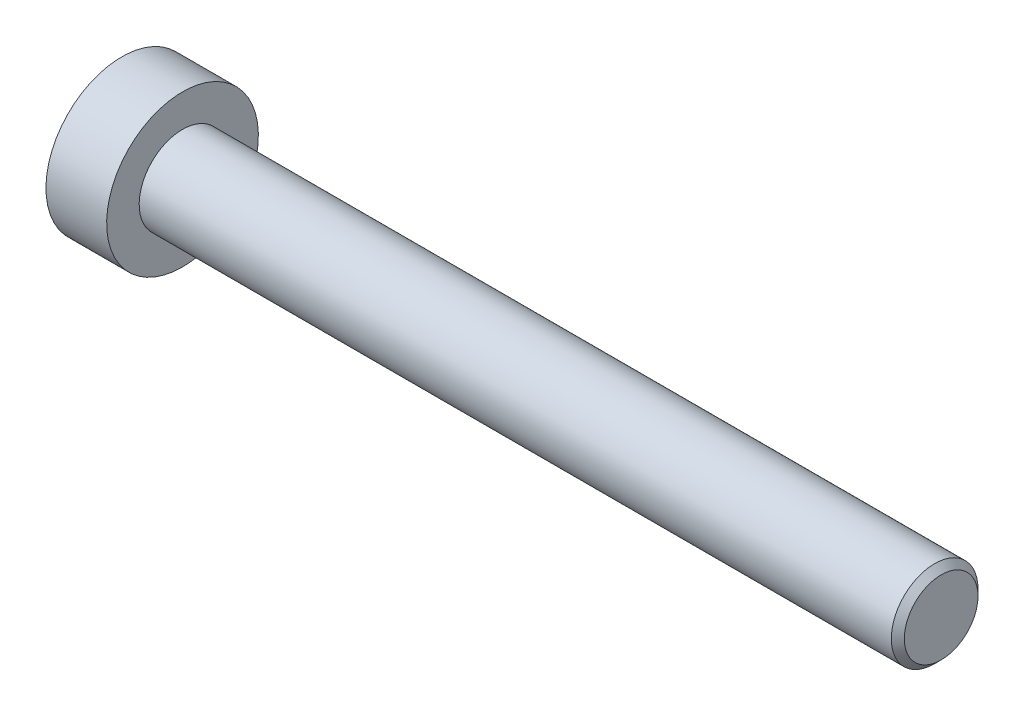
ISO-10303-21;
HEADER;
FILE_DESCRIPTION(('STEP AP214'),'2;1');
FILE_NAME('part.step','',(''),(''),'','','');
FILE_SCHEMA(('AUTOMOTIVE_DESIGN { 1 0 10303 214 1 1 1 1 }'));
ENDSEC;
DATA;
#1=APPLICATION_CONTEXT('core data for automotive mechanical design processes');
#2=APPLICATION_PROTOCOL_DEFINITION('international standard','automotive_design',2000,#1);
#3=PRODUCT_CONTEXT('',#1,'mechanical');
#4=PRODUCT('Part','Part','',(#3));
#5=PRODUCT_RELATED_PRODUCT_CATEGORY('part','',(#4));
#6=PRODUCT_DEFINITION_FORMATION('','',#4);
#7=PRODUCT_DEFINITION_CONTEXT('part definition',#1,'design');
#8=PRODUCT_DEFINITION('design','',#6,#7);
#9=PRODUCT_DEFINITION_SHAPE('','',#8);
#10=(LENGTH_UNIT() NAMED_UNIT(*) SI_UNIT(.MILLI.,.METRE.));
#11=(NAMED_UNIT(*) PLANE_ANGLE_UNIT() SI_UNIT($,.RADIAN.));
#12=(NAMED_UNIT(*) SI_UNIT($,.STERADIAN.) SOLID_ANGLE_UNIT());
#13=UNCERTAINTY_MEASURE_WITH_UNIT(LENGTH_MEASURE(1.E-05),#10,'distance_accuracy_value','');
#14=(GEOMETRIC_REPRESENTATION_CONTEXT(3) GLOBAL_UNCERTAINTY_ASSIGNED_CONTEXT((#13)) GLOBAL_UNIT_ASSIGNED_CONTEXT((#10,
#11,#12)) REPRESENTATION_CONTEXT('',''));
#15=CARTESIAN_POINT('',(0.,0.,0.));
#16=DIRECTION('',(0.,0.,1.));
#17=DIRECTION('',(1.,0.,0.));
#18=AXIS2_PLACEMENT_3D('',#15,#16,#17);
#19=CARTESIAN_POINT('',(-35.,0.,0.));
#20=DIRECTION('',(1.,0.,0.));
#21=DIRECTION('',(0.,0.,-1.));
#22=AXIS2_PLACEMENT_3D('',#19,#20,#21);
#23=CYLINDRICAL_SURFACE('',#22,2.);
#24=CARTESIAN_POINT('',(-0.299999999999995,0.,0.));
#25=DIRECTION('',(1.,0.,0.));
#26=DIRECTION('',(0.,0.,-1.));
#27=AXIS2_PLACEMENT_3D('',#24,#25,#26);
#28=CIRCLE('',#27,2.);
#29=CARTESIAN_POINT('',(-0.299999999999995,0.,-2.));
#30=VERTEX_POINT('',#29);
#31=EDGE_CURVE('E46',#30,#30,#28,.F.);
#32=ORIENTED_EDGE('',*,*,#31,.T.);
#33=EDGE_LOOP('',(#32));
#34=FACE_BOUND('',#33,.T.);
#35=CARTESIAN_POINT('',(-35.,0.,0.));
#36=DIRECTION('',(-1.,0.,0.));
#37=DIRECTION('',(0.,-1.,0.));
#38=AXIS2_PLACEMENT_3D('',#35,#36,#37);
#39=CIRCLE('',#38,2.);
#40=CARTESIAN_POINT('',(-35.,-2.00000000000001,0.));
#41=VERTEX_POINT('',#40);
#42=EDGE_CURVE('E122',#41,#41,#39,.F.);
#43=ORIENTED_EDGE('',*,*,#42,.T.);
#44=EDGE_LOOP('',(#43));
#45=FACE_BOUND('',#44,.T.);
#46=ADVANCED_FACE('F33',(#34,#45),#23,.T.);
#47=CARTESIAN_POINT('',(0.,0.,0.));
#48=DIRECTION('',(1.,0.,0.));
#49=DIRECTION('',(0.,0.,-1.));
#50=AXIS2_PLACEMENT_3D('',#47,#48,#49);
#51=PLANE('',#50);
#52=CARTESIAN_POINT('',(0.,0.,0.));
#53=DIRECTION('',(1.,0.,0.));
#54=DIRECTION('',(0.,0.,-1.));
#55=AXIS2_PLACEMENT_3D('',#52,#53,#54);
#56=CIRCLE('',#55,1.7);
#57=CARTESIAN_POINT('',(0.,0.,-1.7));
#58=VERTEX_POINT('',#57);
#59=EDGE_CURVE('E125',#58,#58,#56,.T.);
#60=ORIENTED_EDGE('',*,*,#59,.T.);
#61=EDGE_LOOP('',(#60));
#62=FACE_BOUND('',#61,.T.);
#63=ADVANCED_FACE('F135',(#62),#51,.T.);
#64=CARTESIAN_POINT('',(0.,0.,0.));
#65=DIRECTION('',(-1.,0.,0.));
#66=DIRECTION('',(0.,0.,1.));
#67=AXIS2_PLACEMENT_3D('',#64,#65,#66);
#68=CONICAL_SURFACE('',#67,1.7,0.785398163397451);
#69=ORIENTED_EDGE('',*,*,#31,.F.);
#70=EDGE_LOOP('',(#69));
#71=FACE_BOUND('',#70,.T.);
#72=ORIENTED_EDGE('',*,*,#59,.F.);
#73=EDGE_LOOP('',(#72));
#74=FACE_BOUND('',#73,.T.);
#75=ADVANCED_FACE('F35',(#71,#74),#68,.T.);
#76=CARTESIAN_POINT('',(-37.8,0.,0.));
#77=DIRECTION('',(1.,0.,0.));
#78=DIRECTION('',(0.,1.,0.));
#79=AXIS2_PLACEMENT_3D('',#76,#77,#78);
#80=PLANE('',#79);
#81=CARTESIAN_POINT('',(-37.8,1.44310190235113E-13,0.));
#82=DIRECTION('',(-1.,0.,0.));
#83=DIRECTION('',(0.,-1.,0.));
#84=AXIS2_PLACEMENT_3D('',#81,#82,#83);
#85=CIRCLE('',#84,1.49337567297405);
#86=CARTESIAN_POINT('',(-37.8,-1.49337567297391,0.));
#87=VERTEX_POINT('',#86);
#88=EDGE_CURVE('E235',#87,#87,#85,.T.);
#89=ORIENTED_EDGE('',*,*,#88,.F.);
#90=EDGE_LOOP('',(#89));
#91=FACE_BOUND('',#90,.T.);
#92=CARTESIAN_POINT('',(-37.8,0.,0.));
#93=DIRECTION('',(-1.,0.,0.));
#94=DIRECTION('',(0.,-1.,0.));
#95=AXIS2_PLACEMENT_3D('',#92,#93,#94);
#96=CIRCLE('',#95,3.5);
#97=CARTESIAN_POINT('',(-37.8,-3.50000000000001,0.));
#98=VERTEX_POINT('',#97);
#99=EDGE_CURVE('E119',#98,#98,#96,.T.);
#100=ORIENTED_EDGE('',*,*,#99,.T.);
#101=EDGE_LOOP('',(#100));
#102=FACE_BOUND('',#101,.T.);
#103=ADVANCED_FACE('F134',(#91,#102),#80,.F.);
#104=CARTESIAN_POINT('',(-35.,0.,0.));
#105=DIRECTION('',(-1.,0.,0.));
#106=DIRECTION('',(0.,-1.,0.));
#107=AXIS2_PLACEMENT_3D('',#104,#105,#106);
#108=CYLINDRICAL_SURFACE('',#107,3.5);
#109=ORIENTED_EDGE('',*,*,#99,.F.);
#110=EDGE_LOOP('',(#109));
#111=FACE_BOUND('',#110,.T.);
#112=CARTESIAN_POINT('',(-35.,0.,0.));
#113=DIRECTION('',(-1.,0.,0.));
#114=DIRECTION('',(0.,-1.,0.));
#115=AXIS2_PLACEMENT_3D('',#112,#113,#114);
#116=CIRCLE('',#115,3.5);
#117=CARTESIAN_POINT('',(-35.,-3.50000000000001,0.));
#118=VERTEX_POINT('',#117);
#119=EDGE_CURVE('E116',#118,#118,#116,.T.);
#120=ORIENTED_EDGE('',*,*,#119,.T.);
#121=EDGE_LOOP('',(#120));
#122=FACE_BOUND('',#121,.T.);
#123=ADVANCED_FACE('F146',(#111,#122),#108,.T.);
#124=CARTESIAN_POINT('',(-35.,3.5,0.));
#125=DIRECTION('',(-1.,0.,0.));
#126=DIRECTION('',(0.,-1.,0.));
#127=AXIS2_PLACEMENT_3D('',#124,#125,#126);
#128=PLANE('',#127);
#129=ORIENTED_EDGE('',*,*,#42,.F.);
#130=EDGE_LOOP('',(#129));
#131=FACE_BOUND('',#130,.T.);
#132=ORIENTED_EDGE('',*,*,#119,.F.);
#133=EDGE_LOOP('',(#132));
#134=FACE_BOUND('',#133,.T.);
#135=ADVANCED_FACE('F150',(#131,#134),#128,.F.);
#136=CARTESIAN_POINT('',(-37.8,1.44310190235113E-13,0.));
#137=DIRECTION('',(-1.,0.,0.));
#138=DIRECTION('',(0.,-1.,0.));
#139=AXIS2_PLACEMENT_3D('',#136,#137,#138);
#140=CONICAL_SURFACE('',#139,1.49337567297405,0.78539816339745);
#141=ORIENTED_EDGE('',*,*,#88,.T.);
#142=EDGE_LOOP('',(#141));
#143=FACE_BOUND('',#142,.T.);
#144=CARTESIAN_POINT('',(-38.2014021689884,-1.42396736984785,1.25));
#145=CARTESIAN_POINT('',(-38.1752961364481,-1.38922450814761,1.25));
#146=CARTESIAN_POINT('',(-38.1494506563431,-1.35428640192983,1.25));
#147=CARTESIAN_POINT('',(-38.0983879120234,-1.28394100441949,1.25));
#148=CARTESIAN_POINT('',(-38.0731708093588,-1.24853359598563,1.25));
#149=CARTESIAN_POINT('',(-37.9982633539511,-1.14097140016107,1.25));
#150=CARTESIAN_POINT('',(-37.9497190435972,-1.06800495826737,1.25));
#151=CARTESIAN_POINT('',(-37.8545600162985,-0.915095472420225,1.25));
#152=CARTESIAN_POINT('',(-37.8082030382604,-0.834990154954369,1.25));
#153=CARTESIAN_POINT('',(-37.7235039270025,-0.670798348959287,1.25));
#154=CARTESIAN_POINT('',(-37.6851347978723,-0.586726487937036,1.25));
#155=CARTESIAN_POINT('',(-37.6381985020476,-0.460385334768575,1.25));
#156=CARTESIAN_POINT('',(-37.6247021207698,-0.419954113336481,1.25));
#157=CARTESIAN_POINT('',(-37.6009573074475,-0.33812903129116,1.25));
#158=CARTESIAN_POINT('',(-37.5907091035293,-0.296735103284054,1.25));
#159=CARTESIAN_POINT('',(-37.5741594663553,-0.213916243687668,1.25));
#160=CARTESIAN_POINT('',(-37.5677913385525,-0.172504848949217,1.25));
#161=CARTESIAN_POINT('',(-37.5591237196609,-0.0892560954740761,1.25));
#162=CARTESIAN_POINT('',(-37.5568235599982,-0.0474188078701848,1.25));
#163=CARTESIAN_POINT('',(-37.5564564105194,0.0348235296906206,1.25));
#164=CARTESIAN_POINT('',(-37.5582455485416,0.0752279922917968,1.25));
#165=CARTESIAN_POINT('',(-37.5656448035135,0.155687005579725,1.25));
#166=CARTESIAN_POINT('',(-37.5712556629701,0.195741486738079,1.25));
#167=CARTESIAN_POINT('',(-37.5860898151071,0.275882483894785,1.25));
#168=CARTESIAN_POINT('',(-37.5953738895404,0.315957579678888,1.25));
#169=CARTESIAN_POINT('',(-37.6170656964992,0.395234027395396,1.25));
#170=CARTESIAN_POINT('',(-37.6294731489784,0.434435457319036,1.25));
#171=CARTESIAN_POINT('',(-37.6734108304631,0.558570325397234,1.25));
#172=CARTESIAN_POINT('',(-37.709974414329,0.641718054006054,1.25));
#173=CARTESIAN_POINT('',(-37.7912478873066,0.804100725662195,1.25));
#174=CARTESIAN_POINT('',(-37.8359871895298,0.883320183915984,1.25));
#175=CARTESIAN_POINT('',(-37.9282652286461,1.03470895505833,1.25));
#176=CARTESIAN_POINT('',(-37.9755534388818,1.10703287925049,1.25));
#177=CARTESIAN_POINT('',(-38.0486463209253,1.21358798649202,1.25));
#178=CARTESIAN_POINT('',(-38.0732664432996,1.24864609054893,1.25));
#179=CARTESIAN_POINT('',(-38.123155260131,1.3182838080566,1.25));
#180=CARTESIAN_POINT('',(-38.1484237758018,1.35286354944705,1.25));
#181=CARTESIAN_POINT('',(-38.1739610581169,1.38724419886399,1.25));
#182=B_SPLINE_CURVE_WITH_KNOTS('',3,(#144,#145,#146,#147,#148,#149,#150,#151,#152,#153,#154,
#155,#156,#157,#158,#159,#160,#161,#162,#163,#164,#165,#166,#167,#168,#169,#170,#171,#172,#173,
#174,#175,#176,#177,#178,#179,#180,#181),.UNSPECIFIED.,.F.,.F.,(4,2,2,2,2,2,2,2,2,2,2,2,2,2,2,2,
2,2,4),(0.,0.130370422461745,0.260774023229274,0.523571931962168,0.800995227642773,
1.0774651455394,1.20522972687281,1.33300327939669,1.45851355132213,1.58400319361987,
1.70514602294319,1.82631239533594,1.94957373840989,2.07282403363803,2.34451838945518,
2.61721016161581,2.87631588769058,3.00482945023597,3.13330794967358),.UNSPECIFIED.);
#183=CARTESIAN_POINT('',(-37.75,-0.721687836486888,1.25));
#184=VERTEX_POINT('',#183);
#185=CARTESIAN_POINT('',(-37.75,0.721687836487177,1.25));
#186=VERTEX_POINT('',#185);
#187=EDGE_CURVE('E100',#184,#186,#182,.T.);
#188=ORIENTED_EDGE('',*,*,#187,.F.);
#189=CARTESIAN_POINT('',(-37.7501154839092,-1.44349114302776,-0.000200000000001163));
#190=CARTESIAN_POINT('',(-37.7253216680551,-1.41867941875051,0.0427751670715872));
#191=CARTESIAN_POINT('',(-37.7019837344187,-1.39345276980729,0.0864690047459489));
#192=CARTESIAN_POINT('',(-37.6592520040846,-1.3420126355418,0.175565930841942));
#193=CARTESIAN_POINT('',(-37.6398819923604,-1.31579425481262,0.220977498357064));
#194=CARTESIAN_POINT('',(-37.6067004834135,-1.26292610442232,0.312547820935259));
#195=CARTESIAN_POINT('',(-37.5928055590527,-1.23628980770457,0.358683240175886));
#196=CARTESIAN_POINT('',(-37.5713972821607,-1.18243062538494,0.451970080407594));
#197=CARTESIAN_POINT('',(-37.5638679415668,-1.15520938653747,0.499118649136381));
#198=CARTESIAN_POINT('',(-37.5570744980507,-1.10829684367452,0.580373556887253));
#199=CARTESIAN_POINT('',(-37.5560685591044,-1.08866617256944,0.614374876627942));
#200=CARTESIAN_POINT('',(-37.5577614149113,-1.04943932800597,0.682317764432478));
#201=CARTESIAN_POINT('',(-37.5604610272156,-1.02984316311585,0.716259317655658));
#202=CARTESIAN_POINT('',(-37.5694089303164,-0.990839954603355,0.7838148564575));
#203=CARTESIAN_POINT('',(-37.5756605258997,-0.971433104248627,0.817428507286776));
#204=CARTESIAN_POINT('',(-37.5913756814139,-0.932943395609761,0.884094638217814));
#205=CARTESIAN_POINT('',(-37.6008406200875,-0.913860680098156,0.917146871030297));
#206=CARTESIAN_POINT('',(-37.6289313906876,-0.864986351354424,1.00179969160026));
#207=CARTESIAN_POINT('',(-37.6496701574522,-0.835502920148932,1.05286649242964));
#208=CARTESIAN_POINT('',(-37.6963871346715,-0.777690319475765,1.15300085411325));
#209=CARTESIAN_POINT('',(-37.7223482959468,-0.749357745598274,1.20207431157827));
#210=CARTESIAN_POINT('',(-37.7501154839091,-0.721572366433052,1.2502));
#211=B_SPLINE_CURVE_WITH_KNOTS('',3,(#189,#190,#191,#192,#193,#194,#195,#196,#197,#198,#199,
#200,#201,#202,#203,#204,#205,#206,#207,#208,#209,#210),.UNSPECIFIED.,.F.,.F.,(4,2,2,2,2,2,2,2,
2,2,4),(0.,0.166533409618306,0.334037607289763,0.498880396489701,0.663307919240277,
0.780963963458829,0.898645970148455,1.01643764860774,1.1342799317155,1.32148652032141,
1.50809158792573),.UNSPECIFIED.);
#212=CARTESIAN_POINT('',(-37.75,-1.44337567297392,0.));
#213=VERTEX_POINT('',#212);
#214=EDGE_CURVE('E192',#213,#184,#211,.T.);
#215=ORIENTED_EDGE('',*,*,#214,.F.);
#216=CARTESIAN_POINT('',(-37.7501154839091,-0.72157236643305,-1.2502));
#217=CARTESIAN_POINT('',(-37.7253216680551,-0.7463840907103,-1.20722483292841));
#218=CARTESIAN_POINT('',(-37.7019837344187,-0.77161073965352,-1.16353099525405));
#219=CARTESIAN_POINT('',(-37.6592520040845,-0.82305087391901,-1.07443406915806));
#220=CARTESIAN_POINT('',(-37.6398819923604,-0.849269254648188,-1.02902250164294));
#221=CARTESIAN_POINT('',(-37.6067004834135,-0.90213740503849,-0.937452179064742));
#222=CARTESIAN_POINT('',(-37.5928055590527,-0.928773701756242,-0.891316759824116));
#223=CARTESIAN_POINT('',(-37.5713972821607,-0.982632884075867,-0.79802991959241));
#224=CARTESIAN_POINT('',(-37.5638679415668,-1.00985412292334,-0.750881350863623));
#225=CARTESIAN_POINT('',(-37.5570744980507,-1.05676666578628,-0.669626443112752));
#226=CARTESIAN_POINT('',(-37.5560685591044,-1.07639733689137,-0.635625123372064));
#227=CARTESIAN_POINT('',(-37.5577614149113,-1.11562418145484,-0.567682235567528));
#228=CARTESIAN_POINT('',(-37.5604610272156,-1.13522034634496,-0.533740682344348));
#229=CARTESIAN_POINT('',(-37.5694089303164,-1.17422355485745,-0.466185143542506));
#230=CARTESIAN_POINT('',(-37.5756605258997,-1.19363040521218,-0.432571492713231));
#231=CARTESIAN_POINT('',(-37.5913756814139,-1.23212011385104,-0.365905361782193));
#232=CARTESIAN_POINT('',(-37.6008406200875,-1.25120282936265,-0.332853128969711));
#233=CARTESIAN_POINT('',(-37.6289313906876,-1.30007715810638,-0.248200308399741));
#234=CARTESIAN_POINT('',(-37.6496701574522,-1.32956058931187,-0.197133507570367));
#235=CARTESIAN_POINT('',(-37.6963871346715,-1.38737318998504,-0.096999145886748));
#236=CARTESIAN_POINT('',(-37.7223482959468,-1.41570576386254,-0.0479256884217322));
#237=CARTESIAN_POINT('',(-37.7501154839092,-1.44349114302776,0.000199999999998532));
#238=B_SPLINE_CURVE_WITH_KNOTS('',3,(#216,#217,#218,#219,#220,#221,#222,#223,#224,#225,#226,
#227,#228,#229,#230,#231,#232,#233,#234,#235,#236,#237),.UNSPECIFIED.,.F.,.F.,(4,2,2,2,2,2,2,2,
2,2,4),(0.,0.166533409618303,0.334037607289758,0.498880396489694,0.663307919240267,
0.780963963458819,0.898645970148445,1.01643764860772,1.13427993171549,1.3214865203214,
1.50809158792573),.UNSPECIFIED.);
#239=CARTESIAN_POINT('',(-37.75,-0.721687836486889,-1.25));
#240=VERTEX_POINT('',#239);
#241=EDGE_CURVE('E187',#240,#213,#238,.T.);
#242=ORIENTED_EDGE('',*,*,#241,.F.);
#243=CARTESIAN_POINT('',(-38.2014021689884,-1.42396736984784,-1.25));
#244=CARTESIAN_POINT('',(-38.1752961364481,-1.38922450814761,-1.25));
#245=CARTESIAN_POINT('',(-38.1494506563431,-1.35428640192982,-1.25));
#246=CARTESIAN_POINT('',(-38.0983879120234,-1.28394100441949,-1.25));
#247=CARTESIAN_POINT('',(-38.0731708093588,-1.24853359598563,-1.25));
#248=CARTESIAN_POINT('',(-37.9982633539511,-1.14097140016106,-1.25));
#249=CARTESIAN_POINT('',(-37.9497190435972,-1.06800495826737,-1.25));
#250=CARTESIAN_POINT('',(-37.8545600162985,-0.915095472420224,-1.25));
#251=CARTESIAN_POINT('',(-37.8082030382604,-0.834990154954368,-1.25));
#252=CARTESIAN_POINT('',(-37.7235039270025,-0.670798348959286,-1.25));
#253=CARTESIAN_POINT('',(-37.6851347978723,-0.586726487937035,-1.25));
#254=CARTESIAN_POINT('',(-37.6381985020476,-0.460385334768573,-1.25));
#255=CARTESIAN_POINT('',(-37.6247021207698,-0.419954113336479,-1.25));
#256=CARTESIAN_POINT('',(-37.6009573074475,-0.338129031291158,-1.25));
#257=CARTESIAN_POINT('',(-37.5907091035293,-0.296735103284052,-1.25));
#258=CARTESIAN_POINT('',(-37.5741594663553,-0.213916243687667,-1.25));
#259=CARTESIAN_POINT('',(-37.5677913385525,-0.172504848949215,-1.25));
#260=CARTESIAN_POINT('',(-37.5591237196609,-0.0892560954740745,-1.25));
#261=CARTESIAN_POINT('',(-37.5568235599982,-0.0474188078701832,-1.25));
#262=CARTESIAN_POINT('',(-37.5564564105194,0.0348235296906225,-1.25));
#263=CARTESIAN_POINT('',(-37.5582455485416,0.0752279922917989,-1.25));
#264=CARTESIAN_POINT('',(-37.5656448035135,0.155687005579727,-1.25));
#265=CARTESIAN_POINT('',(-37.5712556629701,0.195741486738081,-1.25));
#266=CARTESIAN_POINT('',(-37.5860898151071,0.275882483894789,-1.25));
#267=CARTESIAN_POINT('',(-37.5953738895404,0.315957579678893,-1.25));
#268=CARTESIAN_POINT('',(-37.6170656964992,0.3952340273954,-1.25));
#269=CARTESIAN_POINT('',(-37.6294731489784,0.434435457319039,-1.25));
#270=CARTESIAN_POINT('',(-37.6734108304631,0.558570325397238,-1.25));
#271=CARTESIAN_POINT('',(-37.709974414329,0.641718054006059,-1.25));
#272=CARTESIAN_POINT('',(-37.7912478873066,0.804100725662202,-1.25));
#273=CARTESIAN_POINT('',(-37.8359871895298,0.883320183915993,-1.25));
#274=CARTESIAN_POINT('',(-37.9282652286461,1.03470895505834,-1.25));
#275=CARTESIAN_POINT('',(-37.9755534388818,1.1070328792505,-1.25));
#276=CARTESIAN_POINT('',(-38.0486463209253,1.21358798649203,-1.25));
#277=CARTESIAN_POINT('',(-38.0732664432996,1.24864609054894,-1.25));
#278=CARTESIAN_POINT('',(-38.1231552601311,1.31828380805661,-1.25));
#279=CARTESIAN_POINT('',(-38.1484237758018,1.35286354944706,-1.25));
#280=CARTESIAN_POINT('',(-38.1739610581169,1.38724419886399,-1.25));
#281=B_SPLINE_CURVE_WITH_KNOTS('',3,(#243,#244,#245,#246,#247,#248,#249,#250,#251,#252,#253,
#254,#255,#256,#257,#258,#259,#260,#261,#262,#263,#264,#265,#266,#267,#268,#269,#270,#271,#272,
#273,#274,#275,#276,#277,#278,#279,#280),.UNSPECIFIED.,.F.,.F.,(4,2,2,2,2,2,2,2,2,2,2,2,2,2,2,2,
2,2,4),(0.,0.130370422461745,0.260774023229275,0.523571931962167,0.800995227642771,
1.0774651455394,1.20522972687281,1.33300327939669,1.45851355132213,1.58400319361987,
1.70514602294319,1.82631239533594,1.94957373840989,2.07282403363803,2.34451838945518,
2.61721016161582,2.87631588769059,3.00482945023599,3.13330794967359),.UNSPECIFIED.);
#282=CARTESIAN_POINT('',(-37.75,0.721687836487177,-1.25));
#283=VERTEX_POINT('',#282);
#284=EDGE_CURVE('E53',#283,#240,#281,.F.);
#285=ORIENTED_EDGE('',*,*,#284,.F.);
#286=CARTESIAN_POINT('',(-37.7501154839091,1.44349114302805,0.000199999999999847));
#287=CARTESIAN_POINT('',(-37.7253216680551,1.4186794187508,-0.0427751670715873));
#288=CARTESIAN_POINT('',(-37.7019837344187,1.39345276980758,-0.0864690047459491));
#289=CARTESIAN_POINT('',(-37.6592520040845,1.34201263554209,-0.175565930841943));
#290=CARTESIAN_POINT('',(-37.6398819923604,1.31579425481291,-0.220977498357064));
#291=CARTESIAN_POINT('',(-37.6067004834135,1.26292610442261,-0.312547820935259));
#292=CARTESIAN_POINT('',(-37.5928055590527,1.23628980770485,-0.358683240175885));
#293=CARTESIAN_POINT('',(-37.5713972821606,1.18243062538523,-0.451970080407591));
#294=CARTESIAN_POINT('',(-37.5638679415668,1.15520938653776,-0.499118649136378));
#295=CARTESIAN_POINT('',(-37.5570744980507,1.10829684367481,-0.580373556887251));
#296=CARTESIAN_POINT('',(-37.5560685591044,1.08866617256972,-0.61437487662794));
#297=CARTESIAN_POINT('',(-37.5577614149113,1.04943932800625,-0.682317764432476));
#298=CARTESIAN_POINT('',(-37.5604610272155,1.02984316311614,-0.716259317655656));
#299=CARTESIAN_POINT('',(-37.5694089303164,0.990839954603643,-0.783814856457498));
#300=CARTESIAN_POINT('',(-37.5756605258997,0.971433104248915,-0.817428507286774));
#301=CARTESIAN_POINT('',(-37.5913756814139,0.93294339561005,-0.884094638217812));
#302=CARTESIAN_POINT('',(-37.6008406200875,0.913860680098445,-0.917146871030294));
#303=CARTESIAN_POINT('',(-37.6289313906876,0.864986351354713,-1.00179969160026));
#304=CARTESIAN_POINT('',(-37.6496701574522,0.835502920149221,-1.05286649242964));
#305=CARTESIAN_POINT('',(-37.6963871346715,0.777690319476053,-1.15300085411325));
#306=CARTESIAN_POINT('',(-37.7223482959468,0.749357745598561,-1.20207431157827));
#307=CARTESIAN_POINT('',(-37.7501154839091,0.721572366433339,-1.2502));
#308=B_SPLINE_CURVE_WITH_KNOTS('',3,(#286,#287,#288,#289,#290,#291,#292,#293,#294,#295,#296,
#297,#298,#299,#300,#301,#302,#303,#304,#305,#306,#307),.UNSPECIFIED.,.F.,.F.,(4,2,2,2,2,2,2,2,
2,2,4),(0.,0.166533409618305,0.33403760728976,0.498880396489695,0.663307919240271,
0.780963963458824,0.89864597014845,1.01643764860773,1.13427993171549,1.3214865203214,
1.50809158792573),.UNSPECIFIED.);
#309=CARTESIAN_POINT('',(-37.75,1.44337567297421,0.));
#310=VERTEX_POINT('',#309);
#311=EDGE_CURVE('E11',#310,#283,#308,.T.);
#312=ORIENTED_EDGE('',*,*,#311,.F.);
#313=CARTESIAN_POINT('',(-37.7501154839091,0.721572366433338,1.2502));
#314=CARTESIAN_POINT('',(-37.7253216680551,0.746384090710587,1.20722483292841));
#315=CARTESIAN_POINT('',(-37.7019837344187,0.771610739653807,1.16353099525405));
#316=CARTESIAN_POINT('',(-37.6592520040845,0.823050873919297,1.07443406915806));
#317=CARTESIAN_POINT('',(-37.6398819923604,0.849269254648475,1.02902250164294));
#318=CARTESIAN_POINT('',(-37.6067004834135,0.902137405038776,0.937452179064745));
#319=CARTESIAN_POINT('',(-37.5928055590527,0.928773701756527,0.891316759824121));
#320=CARTESIAN_POINT('',(-37.5713972821606,0.982632884076152,0.798029919592415));
#321=CARTESIAN_POINT('',(-37.5638679415668,1.00985412292362,0.750881350863628));
#322=CARTESIAN_POINT('',(-37.5570744980507,1.05676666578657,0.669626443112757));
#323=CARTESIAN_POINT('',(-37.5560685591044,1.07639733689166,0.635625123372068));
#324=CARTESIAN_POINT('',(-37.5577614149113,1.11562418145512,0.567682235567532));
#325=CARTESIAN_POINT('',(-37.5604610272155,1.13522034634524,0.533740682344352));
#326=CARTESIAN_POINT('',(-37.5694089303164,1.17422355485774,0.46618514354251));
#327=CARTESIAN_POINT('',(-37.5756605258997,1.19363040521246,0.432571492713235));
#328=CARTESIAN_POINT('',(-37.5913756814139,1.23212011385133,0.365905361782196));
#329=CARTESIAN_POINT('',(-37.6008406200875,1.25120282936293,0.332853128969714));
#330=CARTESIAN_POINT('',(-37.6289313906876,1.30007715810667,0.248200308399744));
#331=CARTESIAN_POINT('',(-37.6496701574522,1.32956058931216,0.19713350757037));
#332=CARTESIAN_POINT('',(-37.6963871346715,1.38737318998533,0.0969991458867506));
#333=CARTESIAN_POINT('',(-37.7223482959468,1.41570576386282,0.0479256884217343));
#334=CARTESIAN_POINT('',(-37.7501154839091,1.44349114302805,-0.000199999999998277));
#335=B_SPLINE_CURVE_WITH_KNOTS('',3,(#313,#314,#315,#316,#317,#318,#319,#320,#321,#322,#323,
#324,#325,#326,#327,#328,#329,#330,#331,#332,#333,#334),.UNSPECIFIED.,.F.,.F.,(4,2,2,2,2,2,2,2,
2,2,4),(0.,0.166533409618302,0.334037607289756,0.498880396489691,0.663307919240265,
0.780963963458817,0.898645970148443,1.01643764860772,1.13427993171548,1.3214865203214,
1.50809158792573),.UNSPECIFIED.);
#336=EDGE_CURVE('E91',#186,#310,#335,.T.);
#337=ORIENTED_EDGE('',*,*,#336,.F.);
#338=EDGE_LOOP('',(#188,#215,#242,#285,#312,#337));
#339=FACE_BOUND('',#338,.T.);
#340=ADVANCED_FACE('F90',(#143,#339),#140,.F.);
#341=CARTESIAN_POINT('',(-36.2,3.57331579885854E-13,0.));
#342=DIRECTION('',(-1.,0.,0.));
#343=DIRECTION('',(0.,-1.,0.));
#344=AXIS2_PLACEMENT_3D('',#341,#342,#343);
#345=PLANE('',#344);
#346=DIRECTION('',(0.,0.5,-0.866025403784439));
#347=VECTOR('',#346,1.);
#348=CARTESIAN_POINT('',(-36.2,0.721687836487171,1.25));
#349=LINE('',#348,#347);
#350=CARTESIAN_POINT('',(-36.2,0.721687836487171,1.25));
#351=VERTEX_POINT('',#350);
#352=CARTESIAN_POINT('',(-36.2,1.4433756729742,0.));
#353=VERTEX_POINT('',#352);
#354=EDGE_CURVE('E99',#351,#353,#349,.T.);
#355=ORIENTED_EDGE('',*,*,#354,.T.);
#356=DIRECTION('',(0.,-0.5,-0.866025403784439));
#357=VECTOR('',#356,1.);
#358=CARTESIAN_POINT('',(-36.2,1.4433756729742,0.));
#359=LINE('',#358,#357);
#360=CARTESIAN_POINT('',(-36.2,0.721687836487171,-1.25));
#361=VERTEX_POINT('',#360);
#362=EDGE_CURVE('E104',#353,#361,#359,.T.);
#363=ORIENTED_EDGE('',*,*,#362,.T.);
#364=DIRECTION('',(0.,-1.,0.));
#365=VECTOR('',#364,1.);
#366=CARTESIAN_POINT('',(-36.2,0.721687836487171,-1.25));
#367=LINE('',#366,#365);
#368=CARTESIAN_POINT('',(-36.2,-0.721687836486894,-1.25));
#369=VERTEX_POINT('',#368);
#370=EDGE_CURVE('E217',#361,#369,#367,.T.);
#371=ORIENTED_EDGE('',*,*,#370,.T.);
#372=DIRECTION('',(0.,-0.5,0.866025403784439));
#373=VECTOR('',#372,1.);
#374=CARTESIAN_POINT('',(-36.2,-0.721687836486894,-1.25));
#375=LINE('',#374,#373);
#376=CARTESIAN_POINT('',(-36.2,-1.44337567297393,0.));
#377=VERTEX_POINT('',#376);
#378=EDGE_CURVE('E221',#369,#377,#375,.T.);
#379=ORIENTED_EDGE('',*,*,#378,.T.);
#380=DIRECTION('',(0.,0.5,0.866025403784439));
#381=VECTOR('',#380,1.);
#382=CARTESIAN_POINT('',(-36.2,-1.44337567297393,0.));
#383=LINE('',#382,#381);
#384=CARTESIAN_POINT('',(-36.2,-0.721687836486894,1.25));
#385=VERTEX_POINT('',#384);
#386=EDGE_CURVE('E112',#377,#385,#383,.T.);
#387=ORIENTED_EDGE('',*,*,#386,.T.);
#388=DIRECTION('',(0.,1.,0.));
#389=VECTOR('',#388,1.);
#390=CARTESIAN_POINT('',(-36.2,-0.721687836486894,1.25));
#391=LINE('',#390,#389);
#392=EDGE_CURVE('E107',#385,#351,#391,.T.);
#393=ORIENTED_EDGE('',*,*,#392,.T.);
#394=EDGE_LOOP('',(#355,#363,#371,#379,#387,#393));
#395=FACE_BOUND('',#394,.T.);
#396=ADVANCED_FACE('F174',(#395),#345,.T.);
#397=CARTESIAN_POINT('',(-36.2,1.4433756729742,0.));
#398=DIRECTION('',(0.,0.866025403784439,-0.5));
#399=DIRECTION('',(0.,0.5,0.866025403784439));
#400=AXIS2_PLACEMENT_3D('',#397,#398,#399);
#401=PLANE('',#400);
#402=DIRECTION('',(-1.,0.,0.));
#403=VECTOR('',#402,1.);
#404=CARTESIAN_POINT('',(-36.2,1.4433756729742,0.));
#405=LINE('',#404,#403);
#406=EDGE_CURVE('E97',#353,#310,#405,.T.);
#407=ORIENTED_EDGE('',*,*,#406,.T.);
#408=ORIENTED_EDGE('',*,*,#311,.T.);
#409=DIRECTION('',(-1.,0.,0.));
#410=VECTOR('',#409,1.);
#411=CARTESIAN_POINT('',(-36.2,0.721687836487171,-1.25));
#412=LINE('',#411,#410);
#413=EDGE_CURVE('E106',#361,#283,#412,.T.);
#414=ORIENTED_EDGE('',*,*,#413,.F.);
#415=ORIENTED_EDGE('',*,*,#362,.F.);
#416=EDGE_LOOP('',(#407,#408,#414,#415));
#417=FACE_BOUND('',#416,.T.);
#418=ADVANCED_FACE('F102',(#417),#401,.F.);
#419=CARTESIAN_POINT('',(-36.2,0.721687836487171,-1.25));
#420=DIRECTION('',(0.,0.,-1.));
#421=DIRECTION('',(-1.,0.,0.));
#422=AXIS2_PLACEMENT_3D('',#419,#420,#421);
#423=PLANE('',#422);
#424=ORIENTED_EDGE('',*,*,#413,.T.);
#425=ORIENTED_EDGE('',*,*,#284,.T.);
#426=DIRECTION('',(-1.,0.,0.));
#427=VECTOR('',#426,1.);
#428=CARTESIAN_POINT('',(-36.2,-0.721687836486894,-1.25));
#429=LINE('',#428,#427);
#430=EDGE_CURVE('E109',#369,#240,#429,.T.);
#431=ORIENTED_EDGE('',*,*,#430,.F.);
#432=ORIENTED_EDGE('',*,*,#370,.F.);
#433=EDGE_LOOP('',(#424,#425,#431,#432));
#434=FACE_BOUND('',#433,.T.);
#435=ADVANCED_FACE('F206',(#434),#423,.F.);
#436=CARTESIAN_POINT('',(-36.2,-0.721687836486894,-1.25));
#437=DIRECTION('',(0.,-0.866025403784438,-0.5));
#438=DIRECTION('',(0.,0.5,-0.866025403784439));
#439=AXIS2_PLACEMENT_3D('',#436,#437,#438);
#440=PLANE('',#439);
#441=ORIENTED_EDGE('',*,*,#430,.T.);
#442=ORIENTED_EDGE('',*,*,#241,.T.);
#443=DIRECTION('',(-1.,0.,0.));
#444=VECTOR('',#443,1.);
#445=CARTESIAN_POINT('',(-36.2,-1.44337567297393,0.));
#446=LINE('',#445,#444);
#447=EDGE_CURVE('E231',#377,#213,#446,.T.);
#448=ORIENTED_EDGE('',*,*,#447,.F.);
#449=ORIENTED_EDGE('',*,*,#378,.F.);
#450=EDGE_LOOP('',(#441,#442,#448,#449));
#451=FACE_BOUND('',#450,.T.);
#452=ADVANCED_FACE('F201',(#451),#440,.F.);
#453=CARTESIAN_POINT('',(-36.2,-1.44337567297393,0.));
#454=DIRECTION('',(0.,-0.866025403784439,0.5));
#455=DIRECTION('',(0.,-0.5,-0.866025403784439));
#456=AXIS2_PLACEMENT_3D('',#453,#454,#455);
#457=PLANE('',#456);
#458=ORIENTED_EDGE('',*,*,#447,.T.);
#459=ORIENTED_EDGE('',*,*,#214,.T.);
#460=DIRECTION('',(-1.,0.,0.));
#461=VECTOR('',#460,1.);
#462=CARTESIAN_POINT('',(-36.2,-0.721687836486894,1.25));
#463=LINE('',#462,#461);
#464=EDGE_CURVE('E228',#385,#184,#463,.T.);
#465=ORIENTED_EDGE('',*,*,#464,.F.);
#466=ORIENTED_EDGE('',*,*,#386,.F.);
#467=EDGE_LOOP('',(#458,#459,#465,#466));
#468=FACE_BOUND('',#467,.T.);
#469=ADVANCED_FACE('F198',(#468),#457,.F.);
#470=CARTESIAN_POINT('',(-36.2,-0.721687836486894,1.25));
#471=DIRECTION('',(0.,0.,1.));
#472=DIRECTION('',(1.,0.,0.));
#473=AXIS2_PLACEMENT_3D('',#470,#471,#472);
#474=PLANE('',#473);
#475=ORIENTED_EDGE('',*,*,#464,.T.);
#476=ORIENTED_EDGE('',*,*,#187,.T.);
#477=DIRECTION('',(-1.,0.,0.));
#478=VECTOR('',#477,1.);
#479=CARTESIAN_POINT('',(-36.2,0.721687836487171,1.25));
#480=LINE('',#479,#478);
#481=EDGE_CURVE('E60',#351,#186,#480,.T.);
#482=ORIENTED_EDGE('',*,*,#481,.F.);
#483=ORIENTED_EDGE('',*,*,#392,.F.);
#484=EDGE_LOOP('',(#475,#476,#482,#483));
#485=FACE_BOUND('',#484,.T.);
#486=ADVANCED_FACE('F157',(#485),#474,.F.);
#487=CARTESIAN_POINT('',(-36.2,0.721687836487171,1.25));
#488=DIRECTION('',(0.,0.866025403784439,0.5));
#489=DIRECTION('',(0.,-0.5,0.866025403784439));
#490=AXIS2_PLACEMENT_3D('',#487,#488,#489);
#491=PLANE('',#490);
#492=ORIENTED_EDGE('',*,*,#481,.T.);
#493=ORIENTED_EDGE('',*,*,#336,.T.);
#494=ORIENTED_EDGE('',*,*,#406,.F.);
#495=ORIENTED_EDGE('',*,*,#354,.F.);
#496=EDGE_LOOP('',(#492,#493,#494,#495));
#497=FACE_BOUND('',#496,.T.);
#498=ADVANCED_FACE('F96',(#497),#491,.F.);
#499=CLOSED_SHELL('',(#46,#63,#75,#103,#123,#135,#340,#396,#418,#435,#452,#469,#486,#498));
#500=MANIFOLD_SOLID_BREP('B2',#499);
#501=ADVANCED_BREP_SHAPE_REPRESENTATION('',(#18,#500),#14);
#502=SHAPE_DEFINITION_REPRESENTATION(#9,#501);
ENDSEC;
END-ISO-10303-21;
